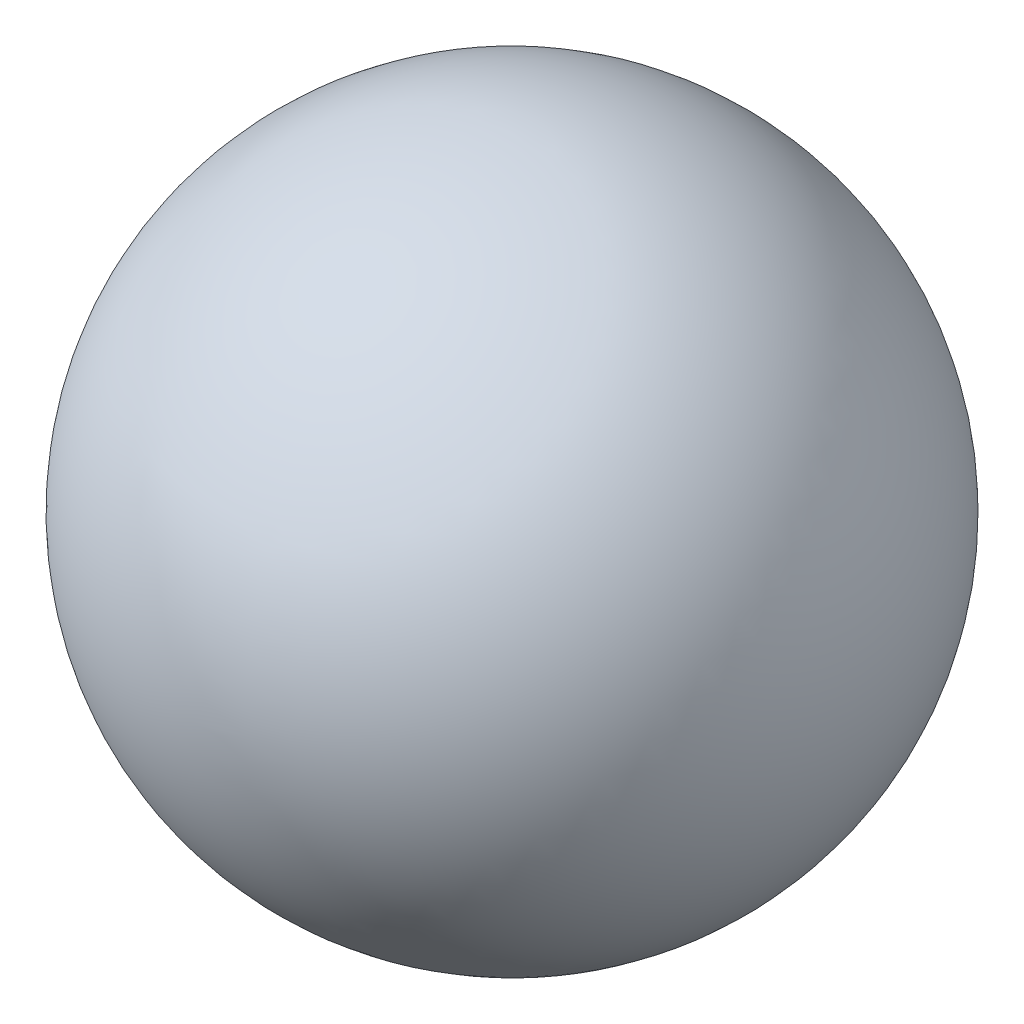
ISO-10303-21;
HEADER;
FILE_DESCRIPTION(('STEP AP214'),'2;1');
FILE_NAME('part.step','',(''),(''),'','','');
FILE_SCHEMA(('AUTOMOTIVE_DESIGN { 1 0 10303 214 1 1 1 1 }'));
ENDSEC;
DATA;
#1=APPLICATION_CONTEXT('core data for automotive mechanical design processes');
#2=APPLICATION_PROTOCOL_DEFINITION('international standard','automotive_design',2000,#1);
#3=PRODUCT_CONTEXT('',#1,'mechanical');
#4=PRODUCT('Part','Part','',(#3));
#5=PRODUCT_RELATED_PRODUCT_CATEGORY('part','',(#4));
#6=PRODUCT_DEFINITION_FORMATION('','',#4);
#7=PRODUCT_DEFINITION_CONTEXT('part definition',#1,'design');
#8=PRODUCT_DEFINITION('design','',#6,#7);
#9=PRODUCT_DEFINITION_SHAPE('','',#8);
#10=(LENGTH_UNIT() NAMED_UNIT(*) SI_UNIT(.MILLI.,.METRE.));
#11=(NAMED_UNIT(*) PLANE_ANGLE_UNIT() SI_UNIT($,.RADIAN.));
#12=(NAMED_UNIT(*) SI_UNIT($,.STERADIAN.) SOLID_ANGLE_UNIT());
#13=UNCERTAINTY_MEASURE_WITH_UNIT(LENGTH_MEASURE(1.E-05),#10,'distance_accuracy_value','');
#14=(GEOMETRIC_REPRESENTATION_CONTEXT(3) GLOBAL_UNCERTAINTY_ASSIGNED_CONTEXT((#13)) GLOBAL_UNIT_ASSIGNED_CONTEXT((#10,
#11,#12)) REPRESENTATION_CONTEXT('',''));
#15=CARTESIAN_POINT('',(0.,0.,0.));
#16=DIRECTION('',(0.,0.,1.));
#17=DIRECTION('',(1.,0.,0.));
#18=AXIS2_PLACEMENT_3D('',#15,#16,#17);
#19=CARTESIAN_POINT('',(64.16,69.1772975263226,5.33874479206886));
#20=DIRECTION('',(0.,0.997035261178121,0.0769460068326368));
#21=DIRECTION('',(0.173648177666935,-0.0757770240921105,0.981888055234759));
#22=AXIS2_PLACEMENT_3D('',#19,#20,#21);
#23=SPHERICAL_SURFACE('',#22,7.15);
#24=CARTESIAN_POINT('',(64.16,62.0484954088991,4.78858084321549));
#25=VERTEX_POINT('',#24);
#26=VERTEX_LOOP('',#25);
#27=FACE_BOUND('',#26,.T.);
#28=CARTESIAN_POINT('',(64.16,76.3060996437461,5.88890874092221));
#29=VERTEX_POINT('',#28);
#30=VERTEX_LOOP('',#29);
#31=FACE_BOUND('',#30,.T.);
#32=ADVANCED_FACE('F15',(#27,#31),#23,.T.);
#33=CLOSED_SHELL('',(#32));
#34=MANIFOLD_SOLID_BREP('B1',#33);
#35=ADVANCED_BREP_SHAPE_REPRESENTATION('',(#18,#34),#14);
#36=SHAPE_DEFINITION_REPRESENTATION(#9,#35);
ENDSEC;
END-ISO-10303-21;
